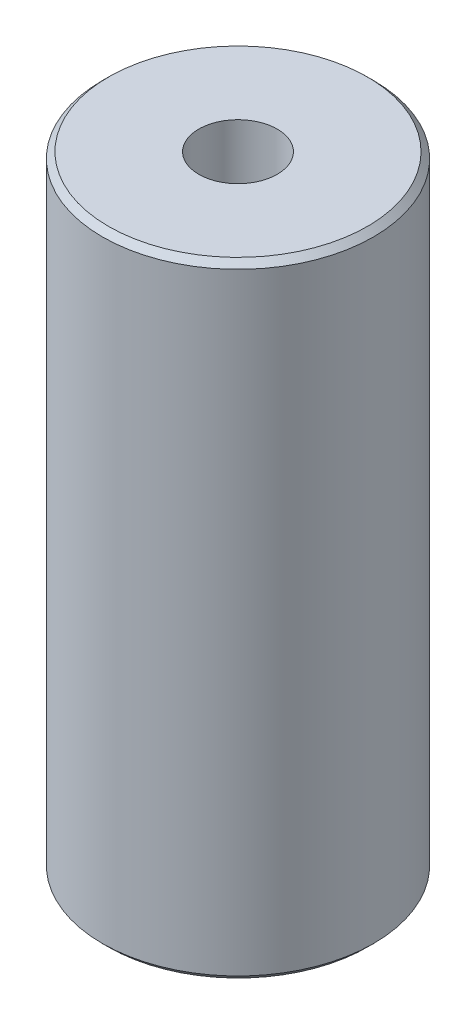
ISO-10303-21;
HEADER;
FILE_DESCRIPTION(('STEP AP214'),'2;1');
FILE_NAME('part.step','',(''),(''),'','','');
FILE_SCHEMA(('AUTOMOTIVE_DESIGN { 1 0 10303 214 1 1 1 1 }'));
ENDSEC;
DATA;
#1=APPLICATION_CONTEXT('core data for automotive mechanical design processes');
#2=APPLICATION_PROTOCOL_DEFINITION('international standard','automotive_design',2000,#1);
#3=PRODUCT_CONTEXT('',#1,'mechanical');
#4=PRODUCT('Part','Part','',(#3));
#5=PRODUCT_RELATED_PRODUCT_CATEGORY('part','',(#4));
#6=PRODUCT_DEFINITION_FORMATION('','',#4);
#7=PRODUCT_DEFINITION_CONTEXT('part definition',#1,'design');
#8=PRODUCT_DEFINITION('design','',#6,#7);
#9=PRODUCT_DEFINITION_SHAPE('','',#8);
#10=(LENGTH_UNIT() NAMED_UNIT(*) SI_UNIT(.MILLI.,.METRE.));
#11=(NAMED_UNIT(*) PLANE_ANGLE_UNIT() SI_UNIT($,.RADIAN.));
#12=(NAMED_UNIT(*) SI_UNIT($,.STERADIAN.) SOLID_ANGLE_UNIT());
#13=UNCERTAINTY_MEASURE_WITH_UNIT(LENGTH_MEASURE(1.E-05),#10,'distance_accuracy_value','');
#14=(GEOMETRIC_REPRESENTATION_CONTEXT(3) GLOBAL_UNCERTAINTY_ASSIGNED_CONTEXT((#13)) GLOBAL_UNIT_ASSIGNED_CONTEXT((#10,
#11,#12)) REPRESENTATION_CONTEXT('',''));
#15=CARTESIAN_POINT('',(0.,0.,0.));
#16=DIRECTION('',(0.,0.,1.));
#17=DIRECTION('',(1.,0.,0.));
#18=AXIS2_PLACEMENT_3D('',#15,#16,#17);
#19=CARTESIAN_POINT('',(0.,253.295356816449,0.));
#20=DIRECTION('',(0.,-1.,0.));
#21=DIRECTION('',(0.,0.,-1.));
#22=AXIS2_PLACEMENT_3D('',#19,#20,#21);
#23=CYLINDRICAL_SURFACE('',#22,55.);
#24=CARTESIAN_POINT('',(0.,250.830550655036,0.));
#25=DIRECTION('',(0.,1.,0.));
#26=DIRECTION('',(0.,0.,1.));
#27=AXIS2_PLACEMENT_3D('',#24,#25,#26);
#28=CIRCLE('',#27,55.);
#29=CARTESIAN_POINT('',(0.,250.830550655036,55.));
#30=VERTEX_POINT('',#29);
#31=EDGE_CURVE('E50',#30,#30,#28,.F.);
#32=ORIENTED_EDGE('',*,*,#31,.T.);
#33=EDGE_LOOP('',(#32));
#34=FACE_BOUND('',#33,.T.);
#35=CARTESIAN_POINT('',(0.,2.46480616141354,0.));
#36=DIRECTION('',(0.,1.,0.));
#37=DIRECTION('',(0.,0.,1.));
#38=AXIS2_PLACEMENT_3D('',#35,#36,#37);
#39=CIRCLE('',#38,55.);
#40=CARTESIAN_POINT('',(0.,2.46480616141354,55.));
#41=VERTEX_POINT('',#40);
#42=EDGE_CURVE('E51',#41,#41,#39,.T.);
#43=ORIENTED_EDGE('',*,*,#42,.T.);
#44=EDGE_LOOP('',(#43));
#45=FACE_BOUND('',#44,.T.);
#46=ADVANCED_FACE('F39',(#34,#45),#23,.T.);
#47=CARTESIAN_POINT('',(0.,253.295356816449,0.));
#48=DIRECTION('',(0.,1.,0.));
#49=DIRECTION('',(0.,0.,1.));
#50=AXIS2_PLACEMENT_3D('',#47,#48,#49);
#51=PLANE('',#50);
#52=CARTESIAN_POINT('',(0.,253.295356816449,0.));
#53=DIRECTION('',(0.,1.,0.));
#54=DIRECTION('',(0.,0.,1.));
#55=AXIS2_PLACEMENT_3D('',#52,#53,#54);
#56=CIRCLE('',#55,52.5351938385864);
#57=CARTESIAN_POINT('',(0.,253.295356816449,52.5351938385864));
#58=VERTEX_POINT('',#57);
#59=EDGE_CURVE('E54',#58,#58,#56,.T.);
#60=ORIENTED_EDGE('',*,*,#59,.T.);
#61=EDGE_LOOP('',(#60));
#62=FACE_BOUND('',#61,.T.);
#63=CARTESIAN_POINT('',(0.,253.295356816449,0.));
#64=DIRECTION('',(0.,1.,0.));
#65=DIRECTION('',(0.,0.,1.));
#66=AXIS2_PLACEMENT_3D('',#63,#64,#65);
#67=CIRCLE('',#66,15.9275910144003);
#68=CARTESIAN_POINT('',(0.,253.295356816449,15.9275910144003));
#69=VERTEX_POINT('',#68);
#70=EDGE_CURVE('E58',#69,#69,#67,.T.);
#71=ORIENTED_EDGE('',*,*,#70,.F.);
#72=EDGE_LOOP('',(#71));
#73=FACE_BOUND('',#72,.T.);
#74=ADVANCED_FACE('F69',(#62,#73),#51,.T.);
#75=CARTESIAN_POINT('',(0.,0.,0.));
#76=DIRECTION('',(0.,1.,0.));
#77=DIRECTION('',(0.,0.,1.));
#78=AXIS2_PLACEMENT_3D('',#75,#76,#77);
#79=PLANE('',#78);
#80=CARTESIAN_POINT('',(0.,0.,0.));
#81=DIRECTION('',(0.,1.,0.));
#82=DIRECTION('',(0.,0.,1.));
#83=AXIS2_PLACEMENT_3D('',#80,#81,#82);
#84=CIRCLE('',#83,52.5351938385865);
#85=CARTESIAN_POINT('',(0.,0.,52.5351938385865));
#86=VERTEX_POINT('',#85);
#87=EDGE_CURVE('E10',#86,#86,#84,.F.);
#88=ORIENTED_EDGE('',*,*,#87,.T.);
#89=EDGE_LOOP('',(#88));
#90=FACE_BOUND('',#89,.T.);
#91=CARTESIAN_POINT('',(0.,0.,0.));
#92=DIRECTION('',(0.,1.,0.));
#93=DIRECTION('',(0.,0.,1.));
#94=AXIS2_PLACEMENT_3D('',#91,#92,#93);
#95=CIRCLE('',#94,15.9275910144003);
#96=CARTESIAN_POINT('',(0.,0.,15.9275910144003));
#97=VERTEX_POINT('',#96);
#98=EDGE_CURVE('E63',#97,#97,#95,.T.);
#99=ORIENTED_EDGE('',*,*,#98,.T.);
#100=EDGE_LOOP('',(#99));
#101=FACE_BOUND('',#100,.T.);
#102=ADVANCED_FACE('F75',(#90,#101),#79,.F.);
#103=CARTESIAN_POINT('',(0.,253.295356816449,0.));
#104=DIRECTION('',(0.,-1.,0.));
#105=DIRECTION('',(0.,0.,-1.));
#106=AXIS2_PLACEMENT_3D('',#103,#104,#105);
#107=CYLINDRICAL_SURFACE('',#106,15.9275910144003);
#108=ORIENTED_EDGE('',*,*,#70,.T.);
#109=EDGE_LOOP('',(#108));
#110=FACE_BOUND('',#109,.T.);
#111=ORIENTED_EDGE('',*,*,#98,.F.);
#112=EDGE_LOOP('',(#111));
#113=FACE_BOUND('',#112,.T.);
#114=ADVANCED_FACE('F70',(#110,#113),#107,.F.);
#115=CARTESIAN_POINT('',(0.,253.295356816449,0.));
#116=DIRECTION('',(0.,-1.,0.));
#117=DIRECTION('',(0.,0.,-1.));
#118=AXIS2_PLACEMENT_3D('',#115,#116,#117);
#119=CONICAL_SURFACE('',#118,52.5351938385864,0.785398163397444);
#120=ORIENTED_EDGE('',*,*,#31,.F.);
#121=EDGE_LOOP('',(#120));
#122=FACE_BOUND('',#121,.T.);
#123=ORIENTED_EDGE('',*,*,#59,.F.);
#124=EDGE_LOOP('',(#123));
#125=FACE_BOUND('',#124,.T.);
#126=ADVANCED_FACE('F81',(#122,#125),#119,.T.);
#127=CARTESIAN_POINT('',(0.,2.46480616141354,0.));
#128=DIRECTION('',(0.,1.,0.));
#129=DIRECTION('',(0.,0.,1.));
#130=AXIS2_PLACEMENT_3D('',#127,#128,#129);
#131=CONICAL_SURFACE('',#130,55.,0.78539816339745);
#132=ORIENTED_EDGE('',*,*,#87,.F.);
#133=EDGE_LOOP('',(#132));
#134=FACE_BOUND('',#133,.T.);
#135=ORIENTED_EDGE('',*,*,#42,.F.);
#136=EDGE_LOOP('',(#135));
#137=FACE_BOUND('',#136,.T.);
#138=ADVANCED_FACE('F45',(#134,#137),#131,.T.);
#139=CLOSED_SHELL('',(#46,#74,#102,#114,#126,#138));
#140=MANIFOLD_SOLID_BREP('B2',#139);
#141=ADVANCED_BREP_SHAPE_REPRESENTATION('',(#18,#140),#14);
#142=SHAPE_DEFINITION_REPRESENTATION(#9,#141);
ENDSEC;
END-ISO-10303-21;
